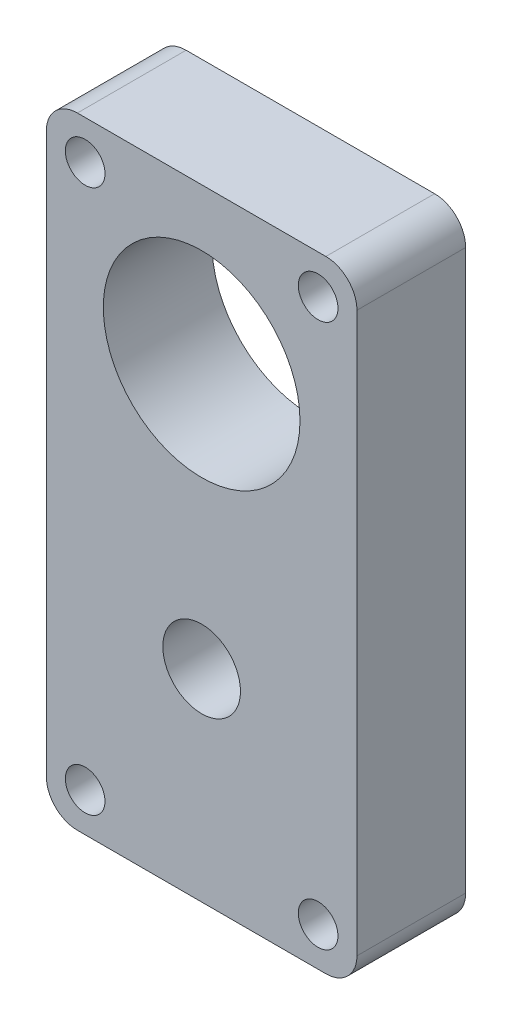
ISO-10303-21;
HEADER;
FILE_DESCRIPTION(('STEP AP214'),'2;1');
FILE_NAME('part.step','',(''),(''),'','','');
FILE_SCHEMA(('AUTOMOTIVE_DESIGN { 1 0 10303 214 1 1 1 1 }'));
ENDSEC;
DATA;
#1=APPLICATION_CONTEXT('core data for automotive mechanical design processes');
#2=APPLICATION_PROTOCOL_DEFINITION('international standard','automotive_design',2000,#1);
#3=PRODUCT_CONTEXT('',#1,'mechanical');
#4=PRODUCT('Part','Part','',(#3));
#5=PRODUCT_RELATED_PRODUCT_CATEGORY('part','',(#4));
#6=PRODUCT_DEFINITION_FORMATION('','',#4);
#7=PRODUCT_DEFINITION_CONTEXT('part definition',#1,'design');
#8=PRODUCT_DEFINITION('design','',#6,#7);
#9=PRODUCT_DEFINITION_SHAPE('','',#8);
#10=(LENGTH_UNIT() NAMED_UNIT(*) SI_UNIT(.MILLI.,.METRE.));
#11=(NAMED_UNIT(*) PLANE_ANGLE_UNIT() SI_UNIT($,.RADIAN.));
#12=(NAMED_UNIT(*) SI_UNIT($,.STERADIAN.) SOLID_ANGLE_UNIT());
#13=UNCERTAINTY_MEASURE_WITH_UNIT(LENGTH_MEASURE(1.E-05),#10,'distance_accuracy_value','');
#14=(GEOMETRIC_REPRESENTATION_CONTEXT(3) GLOBAL_UNCERTAINTY_ASSIGNED_CONTEXT((#13)) GLOBAL_UNIT_ASSIGNED_CONTEXT((#10,
#11,#12)) REPRESENTATION_CONTEXT('',''));
#15=CARTESIAN_POINT('',(0.,0.,0.));
#16=DIRECTION('',(0.,0.,1.));
#17=DIRECTION('',(1.,0.,0.));
#18=AXIS2_PLACEMENT_3D('',#15,#16,#17);
#19=CARTESIAN_POINT('',(0.,-34.,14.));
#20=DIRECTION('',(0.,0.,-1.));
#21=DIRECTION('',(-1.,0.,0.));
#22=AXIS2_PLACEMENT_3D('',#19,#20,#21);
#23=CYLINDRICAL_SURFACE('',#22,5.);
#24=CARTESIAN_POINT('',(0.,-34.,14.));
#25=DIRECTION('',(0.,0.,1.));
#26=DIRECTION('',(1.,0.,0.));
#27=AXIS2_PLACEMENT_3D('',#24,#25,#26);
#28=CIRCLE('',#27,5.);
#29=CARTESIAN_POINT('',(5.,-34.,14.));
#30=VERTEX_POINT('',#29);
#31=EDGE_CURVE('E210',#30,#30,#28,.T.);
#32=ORIENTED_EDGE('',*,*,#31,.T.);
#33=EDGE_LOOP('',(#32));
#34=FACE_BOUND('',#33,.T.);
#35=CARTESIAN_POINT('',(0.,-34.,2.));
#36=DIRECTION('',(0.,0.,-1.));
#37=DIRECTION('',(-1.,0.,0.));
#38=AXIS2_PLACEMENT_3D('',#35,#36,#37);
#39=CIRCLE('',#38,5.);
#40=CARTESIAN_POINT('',(-5.,-34.,2.));
#41=VERTEX_POINT('',#40);
#42=EDGE_CURVE('E38',#41,#41,#39,.T.);
#43=ORIENTED_EDGE('',*,*,#42,.T.);
#44=EDGE_LOOP('',(#43));
#45=FACE_BOUND('',#44,.T.);
#46=ADVANCED_FACE('F34',(#34,#45),#23,.F.);
#47=CARTESIAN_POINT('',(0.,0.,14.));
#48=DIRECTION('',(0.,0.,1.));
#49=DIRECTION('',(1.,0.,0.));
#50=AXIS2_PLACEMENT_3D('',#47,#48,#49);
#51=PLANE('',#50);
#52=CARTESIAN_POINT('',(15.,-55.,14.));
#53=DIRECTION('',(0.,0.,1.));
#54=DIRECTION('',(-1.,0.,0.));
#55=AXIS2_PLACEMENT_3D('',#52,#53,#54);
#56=CIRCLE('',#55,2.55459899986939);
#57=CARTESIAN_POINT('',(12.4454010001306,-55.,14.));
#58=VERTEX_POINT('',#57);
#59=EDGE_CURVE('E204',#58,#58,#56,.T.);
#60=ORIENTED_EDGE('',*,*,#59,.F.);
#61=EDGE_LOOP('',(#60));
#62=FACE_BOUND('',#61,.T.);
#63=CARTESIAN_POINT('',(-15.,-55.,14.));
#64=DIRECTION('',(0.,0.,1.));
#65=DIRECTION('',(-1.,0.,0.));
#66=AXIS2_PLACEMENT_3D('',#63,#64,#65);
#67=CIRCLE('',#66,2.55459899986931);
#68=CARTESIAN_POINT('',(-17.5545989998693,-55.,14.));
#69=VERTEX_POINT('',#68);
#70=EDGE_CURVE('E192',#69,#69,#67,.T.);
#71=ORIENTED_EDGE('',*,*,#70,.F.);
#72=EDGE_LOOP('',(#71));
#73=FACE_BOUND('',#72,.T.);
#74=CARTESIAN_POINT('',(-15.,15.,14.));
#75=DIRECTION('',(0.,0.,1.));
#76=DIRECTION('',(1.,0.,0.));
#77=AXIS2_PLACEMENT_3D('',#74,#75,#76);
#78=CIRCLE('',#77,2.55459899986932);
#79=CARTESIAN_POINT('',(-12.4454010001307,15.,14.));
#80=VERTEX_POINT('',#79);
#81=EDGE_CURVE('E178',#80,#80,#78,.T.);
#82=ORIENTED_EDGE('',*,*,#81,.F.);
#83=EDGE_LOOP('',(#82));
#84=FACE_BOUND('',#83,.T.);
#85=DIRECTION('',(1.,0.,0.));
#86=VECTOR('',#85,1.);
#87=CARTESIAN_POINT('',(-20.,-60.,14.));
#88=LINE('',#87,#86);
#89=CARTESIAN_POINT('',(-16.,-60.,14.));
#90=VERTEX_POINT('',#89);
#91=CARTESIAN_POINT('',(16.,-60.,14.));
#92=VERTEX_POINT('',#91);
#93=EDGE_CURVE('E172',#90,#92,#88,.T.);
#94=ORIENTED_EDGE('',*,*,#93,.T.);
#95=CARTESIAN_POINT('',(16.,-56.,14.));
#96=DIRECTION('',(0.,0.,1.));
#97=DIRECTION('',(1.,0.,0.));
#98=AXIS2_PLACEMENT_3D('',#95,#96,#97);
#99=CIRCLE('',#98,4.);
#100=CARTESIAN_POINT('',(20.,-56.,14.));
#101=VERTEX_POINT('',#100);
#102=EDGE_CURVE('E150',#92,#101,#99,.T.);
#103=ORIENTED_EDGE('',*,*,#102,.T.);
#104=DIRECTION('',(0.,1.,0.));
#105=VECTOR('',#104,1.);
#106=CARTESIAN_POINT('',(20.,-10.,14.));
#107=LINE('',#106,#105);
#108=CARTESIAN_POINT('',(20.,16.,14.));
#109=VERTEX_POINT('',#108);
#110=EDGE_CURVE('E120',#101,#109,#107,.T.);
#111=ORIENTED_EDGE('',*,*,#110,.T.);
#112=CARTESIAN_POINT('',(16.,16.,14.));
#113=DIRECTION('',(0.,0.,1.));
#114=DIRECTION('',(1.,0.,0.));
#115=AXIS2_PLACEMENT_3D('',#112,#113,#114);
#116=CIRCLE('',#115,4.);
#117=CARTESIAN_POINT('',(16.,20.,14.));
#118=VERTEX_POINT('',#117);
#119=EDGE_CURVE('E56',#109,#118,#116,.T.);
#120=ORIENTED_EDGE('',*,*,#119,.T.);
#121=DIRECTION('',(-1.,0.,0.));
#122=VECTOR('',#121,1.);
#123=CARTESIAN_POINT('',(20.,20.,14.));
#124=LINE('',#123,#122);
#125=CARTESIAN_POINT('',(-16.,20.,14.));
#126=VERTEX_POINT('',#125);
#127=EDGE_CURVE('E137',#118,#126,#124,.T.);
#128=ORIENTED_EDGE('',*,*,#127,.T.);
#129=CARTESIAN_POINT('',(-16.,16.,14.));
#130=DIRECTION('',(0.,0.,1.));
#131=DIRECTION('',(1.,0.,0.));
#132=AXIS2_PLACEMENT_3D('',#129,#130,#131);
#133=CIRCLE('',#132,4.);
#134=CARTESIAN_POINT('',(-20.,16.,14.));
#135=VERTEX_POINT('',#134);
#136=EDGE_CURVE('E145',#126,#135,#133,.T.);
#137=ORIENTED_EDGE('',*,*,#136,.T.);
#138=DIRECTION('',(0.,-1.,0.));
#139=VECTOR('',#138,1.);
#140=CARTESIAN_POINT('',(-20.,-9.99999999999999,14.));
#141=LINE('',#140,#139);
#142=CARTESIAN_POINT('',(-20.,-56.,14.));
#143=VERTEX_POINT('',#142);
#144=EDGE_CURVE('E131',#135,#143,#141,.T.);
#145=ORIENTED_EDGE('',*,*,#144,.T.);
#146=CARTESIAN_POINT('',(-16.,-56.,14.));
#147=DIRECTION('',(0.,0.,1.));
#148=DIRECTION('',(1.,0.,0.));
#149=AXIS2_PLACEMENT_3D('',#146,#147,#148);
#150=CIRCLE('',#149,4.);
#151=EDGE_CURVE('E148',#143,#90,#150,.T.);
#152=ORIENTED_EDGE('',*,*,#151,.T.);
#153=EDGE_LOOP('',(#94,#103,#111,#120,#128,#137,#145,#152));
#154=FACE_BOUND('',#153,.T.);
#155=CARTESIAN_POINT('',(0.,0.,14.));
#156=DIRECTION('',(0.,0.,1.));
#157=DIRECTION('',(1.,0.,0.));
#158=AXIS2_PLACEMENT_3D('',#155,#156,#157);
#159=CIRCLE('',#158,12.665);
#160=CARTESIAN_POINT('',(12.665,0.,14.));
#161=VERTEX_POINT('',#160);
#162=EDGE_CURVE('E187',#161,#161,#159,.T.);
#163=ORIENTED_EDGE('',*,*,#162,.F.);
#164=EDGE_LOOP('',(#163));
#165=FACE_BOUND('',#164,.T.);
#166=CARTESIAN_POINT('',(15.,15.,14.));
#167=DIRECTION('',(0.,0.,1.));
#168=DIRECTION('',(1.,0.,0.));
#169=AXIS2_PLACEMENT_3D('',#166,#167,#168);
#170=CIRCLE('',#169,2.55459899986937);
#171=CARTESIAN_POINT('',(17.5545989998694,15.,14.));
#172=VERTEX_POINT('',#171);
#173=EDGE_CURVE('E198',#172,#172,#170,.T.);
#174=ORIENTED_EDGE('',*,*,#173,.F.);
#175=EDGE_LOOP('',(#174));
#176=FACE_BOUND('',#175,.T.);
#177=ORIENTED_EDGE('',*,*,#31,.F.);
#178=EDGE_LOOP('',(#177));
#179=FACE_BOUND('',#178,.T.);
#180=ADVANCED_FACE('F168',(#62,#73,#84,#154,#165,#176,#179),#51,.T.);
#181=CARTESIAN_POINT('',(0.,0.,0.));
#182=DIRECTION('',(0.,0.,1.));
#183=DIRECTION('',(1.,0.,0.));
#184=AXIS2_PLACEMENT_3D('',#181,#182,#183);
#185=PLANE('',#184);
#186=DIRECTION('',(0.,1.,0.));
#187=VECTOR('',#186,1.);
#188=CARTESIAN_POINT('',(20.,-10.,0.));
#189=LINE('',#188,#187);
#190=CARTESIAN_POINT('',(20.,-56.,0.));
#191=VERTEX_POINT('',#190);
#192=CARTESIAN_POINT('',(20.,16.,0.));
#193=VERTEX_POINT('',#192);
#194=EDGE_CURVE('E118',#191,#193,#189,.T.);
#195=ORIENTED_EDGE('',*,*,#194,.F.);
#196=CARTESIAN_POINT('',(16.,-56.,0.));
#197=DIRECTION('',(0.,0.,1.));
#198=DIRECTION('',(1.,0.,0.));
#199=AXIS2_PLACEMENT_3D('',#196,#197,#198);
#200=CIRCLE('',#199,4.);
#201=CARTESIAN_POINT('',(16.,-60.,0.));
#202=VERTEX_POINT('',#201);
#203=EDGE_CURVE('E101',#191,#202,#200,.F.);
#204=ORIENTED_EDGE('',*,*,#203,.T.);
#205=DIRECTION('',(1.,0.,0.));
#206=VECTOR('',#205,1.);
#207=CARTESIAN_POINT('',(-20.,-60.,0.));
#208=LINE('',#207,#206);
#209=CARTESIAN_POINT('',(-16.,-60.,0.));
#210=VERTEX_POINT('',#209);
#211=EDGE_CURVE('E129',#210,#202,#208,.T.);
#212=ORIENTED_EDGE('',*,*,#211,.F.);
#213=CARTESIAN_POINT('',(-16.,-56.,0.));
#214=DIRECTION('',(0.,0.,1.));
#215=DIRECTION('',(1.,0.,0.));
#216=AXIS2_PLACEMENT_3D('',#213,#214,#215);
#217=CIRCLE('',#216,4.);
#218=CARTESIAN_POINT('',(-20.,-56.,0.));
#219=VERTEX_POINT('',#218);
#220=EDGE_CURVE('E112',#210,#219,#217,.F.);
#221=ORIENTED_EDGE('',*,*,#220,.T.);
#222=DIRECTION('',(0.,-1.,0.));
#223=VECTOR('',#222,1.);
#224=CARTESIAN_POINT('',(-20.,-9.99999999999999,0.));
#225=LINE('',#224,#223);
#226=CARTESIAN_POINT('',(-20.,16.,0.));
#227=VERTEX_POINT('',#226);
#228=EDGE_CURVE('E133',#227,#219,#225,.T.);
#229=ORIENTED_EDGE('',*,*,#228,.F.);
#230=CARTESIAN_POINT('',(-16.,16.,0.));
#231=DIRECTION('',(0.,0.,1.));
#232=DIRECTION('',(1.,0.,0.));
#233=AXIS2_PLACEMENT_3D('',#230,#231,#232);
#234=CIRCLE('',#233,4.);
#235=CARTESIAN_POINT('',(-16.,20.,0.));
#236=VERTEX_POINT('',#235);
#237=EDGE_CURVE('E121',#227,#236,#234,.F.);
#238=ORIENTED_EDGE('',*,*,#237,.T.);
#239=DIRECTION('',(-1.,0.,0.));
#240=VECTOR('',#239,1.);
#241=CARTESIAN_POINT('',(20.,20.,0.));
#242=LINE('',#241,#240);
#243=CARTESIAN_POINT('',(16.,20.,0.));
#244=VERTEX_POINT('',#243);
#245=EDGE_CURVE('E128',#244,#236,#242,.T.);
#246=ORIENTED_EDGE('',*,*,#245,.F.);
#247=CARTESIAN_POINT('',(16.,16.,0.));
#248=DIRECTION('',(0.,0.,1.));
#249=DIRECTION('',(1.,0.,0.));
#250=AXIS2_PLACEMENT_3D('',#247,#248,#249);
#251=CIRCLE('',#250,4.);
#252=EDGE_CURVE('E127',#244,#193,#251,.F.);
#253=ORIENTED_EDGE('',*,*,#252,.T.);
#254=EDGE_LOOP('',(#195,#204,#212,#221,#229,#238,#246,#253));
#255=FACE_BOUND('',#254,.T.);
#256=CARTESIAN_POINT('',(-15.,15.,0.));
#257=DIRECTION('',(0.,0.,1.));
#258=DIRECTION('',(1.,0.,0.));
#259=AXIS2_PLACEMENT_3D('',#256,#257,#258);
#260=CIRCLE('',#259,2.55459899986932);
#261=CARTESIAN_POINT('',(-12.4454010001307,15.,0.));
#262=VERTEX_POINT('',#261);
#263=EDGE_CURVE('E180',#262,#262,#260,.T.);
#264=ORIENTED_EDGE('',*,*,#263,.T.);
#265=EDGE_LOOP('',(#264));
#266=FACE_BOUND('',#265,.T.);
#267=CARTESIAN_POINT('',(0.,0.,0.));
#268=DIRECTION('',(0.,0.,1.));
#269=DIRECTION('',(1.,0.,0.));
#270=AXIS2_PLACEMENT_3D('',#267,#268,#269);
#271=CIRCLE('',#270,12.665);
#272=CARTESIAN_POINT('',(12.665,0.,0.));
#273=VERTEX_POINT('',#272);
#274=EDGE_CURVE('E189',#273,#273,#271,.T.);
#275=ORIENTED_EDGE('',*,*,#274,.T.);
#276=EDGE_LOOP('',(#275));
#277=FACE_BOUND('',#276,.T.);
#278=CARTESIAN_POINT('',(-15.,-55.,0.));
#279=DIRECTION('',(0.,0.,1.));
#280=DIRECTION('',(-1.,0.,0.));
#281=AXIS2_PLACEMENT_3D('',#278,#279,#280);
#282=CIRCLE('',#281,2.55459899986931);
#283=CARTESIAN_POINT('',(-17.5545989998693,-55.,0.));
#284=VERTEX_POINT('',#283);
#285=EDGE_CURVE('E195',#284,#284,#282,.T.);
#286=ORIENTED_EDGE('',*,*,#285,.T.);
#287=EDGE_LOOP('',(#286));
#288=FACE_BOUND('',#287,.T.);
#289=CARTESIAN_POINT('',(15.,15.,0.));
#290=DIRECTION('',(0.,0.,1.));
#291=DIRECTION('',(1.,0.,0.));
#292=AXIS2_PLACEMENT_3D('',#289,#290,#291);
#293=CIRCLE('',#292,2.55459899986937);
#294=CARTESIAN_POINT('',(17.5545989998694,15.,0.));
#295=VERTEX_POINT('',#294);
#296=EDGE_CURVE('E201',#295,#295,#293,.T.);
#297=ORIENTED_EDGE('',*,*,#296,.T.);
#298=EDGE_LOOP('',(#297));
#299=FACE_BOUND('',#298,.T.);
#300=CARTESIAN_POINT('',(15.,-55.,0.));
#301=DIRECTION('',(0.,0.,1.));
#302=DIRECTION('',(-1.,0.,0.));
#303=AXIS2_PLACEMENT_3D('',#300,#301,#302);
#304=CIRCLE('',#303,2.55459899986939);
#305=CARTESIAN_POINT('',(12.4454010001306,-55.,0.));
#306=VERTEX_POINT('',#305);
#307=EDGE_CURVE('E207',#306,#306,#304,.T.);
#308=ORIENTED_EDGE('',*,*,#307,.T.);
#309=EDGE_LOOP('',(#308));
#310=FACE_BOUND('',#309,.T.);
#311=ADVANCED_FACE('F124',(#255,#266,#277,#288,#299,#310),#185,.F.);
#312=CARTESIAN_POINT('',(-20.,-9.99999999999999,14.));
#313=DIRECTION('',(1.,0.,0.));
#314=DIRECTION('',(0.,1.,0.));
#315=AXIS2_PLACEMENT_3D('',#312,#313,#314);
#316=PLANE('',#315);
#317=ORIENTED_EDGE('',*,*,#228,.T.);
#318=DIRECTION('',(0.,0.,-1.));
#319=VECTOR('',#318,1.);
#320=CARTESIAN_POINT('',(-20.,-56.,14.));
#321=LINE('',#320,#319);
#322=EDGE_CURVE('E155',#219,#143,#321,.F.);
#323=ORIENTED_EDGE('',*,*,#322,.T.);
#324=ORIENTED_EDGE('',*,*,#144,.F.);
#325=DIRECTION('',(0.,0.,-1.));
#326=VECTOR('',#325,1.);
#327=CARTESIAN_POINT('',(-20.,16.,14.));
#328=LINE('',#327,#326);
#329=EDGE_CURVE('E152',#135,#227,#328,.T.);
#330=ORIENTED_EDGE('',*,*,#329,.T.);
#331=EDGE_LOOP('',(#317,#323,#324,#330));
#332=FACE_BOUND('',#331,.T.);
#333=ADVANCED_FACE('F162',(#332),#316,.F.);
#334=CARTESIAN_POINT('',(-20.,-60.,14.));
#335=DIRECTION('',(0.,1.,0.));
#336=DIRECTION('',(0.,0.,1.));
#337=AXIS2_PLACEMENT_3D('',#334,#335,#336);
#338=PLANE('',#337);
#339=ORIENTED_EDGE('',*,*,#211,.T.);
#340=DIRECTION('',(0.,0.,-1.));
#341=VECTOR('',#340,1.);
#342=CARTESIAN_POINT('',(16.,-60.,14.));
#343=LINE('',#342,#341);
#344=EDGE_CURVE('E106',#202,#92,#343,.F.);
#345=ORIENTED_EDGE('',*,*,#344,.T.);
#346=ORIENTED_EDGE('',*,*,#93,.F.);
#347=DIRECTION('',(0.,0.,-1.));
#348=VECTOR('',#347,1.);
#349=CARTESIAN_POINT('',(-16.,-60.,14.));
#350=LINE('',#349,#348);
#351=EDGE_CURVE('E111',#90,#210,#350,.T.);
#352=ORIENTED_EDGE('',*,*,#351,.T.);
#353=EDGE_LOOP('',(#339,#345,#346,#352));
#354=FACE_BOUND('',#353,.T.);
#355=ADVANCED_FACE('F177',(#354),#338,.F.);
#356=CARTESIAN_POINT('',(20.,-10.,14.));
#357=DIRECTION('',(-1.,0.,0.));
#358=DIRECTION('',(0.,-1.,0.));
#359=AXIS2_PLACEMENT_3D('',#356,#357,#358);
#360=PLANE('',#359);
#361=ORIENTED_EDGE('',*,*,#110,.F.);
#362=DIRECTION('',(0.,0.,-1.));
#363=VECTOR('',#362,1.);
#364=CARTESIAN_POINT('',(20.,-56.,14.));
#365=LINE('',#364,#363);
#366=EDGE_CURVE('E105',#101,#191,#365,.T.);
#367=ORIENTED_EDGE('',*,*,#366,.T.);
#368=ORIENTED_EDGE('',*,*,#194,.T.);
#369=DIRECTION('',(0.,0.,-1.));
#370=VECTOR('',#369,1.);
#371=CARTESIAN_POINT('',(20.,16.,14.));
#372=LINE('',#371,#370);
#373=EDGE_CURVE('E122',#193,#109,#372,.F.);
#374=ORIENTED_EDGE('',*,*,#373,.T.);
#375=EDGE_LOOP('',(#361,#367,#368,#374));
#376=FACE_BOUND('',#375,.T.);
#377=ADVANCED_FACE('F117',(#376),#360,.F.);
#378=CARTESIAN_POINT('',(20.,20.,14.));
#379=DIRECTION('',(0.,-1.,0.));
#380=DIRECTION('',(0.,0.,-1.));
#381=AXIS2_PLACEMENT_3D('',#378,#379,#380);
#382=PLANE('',#381);
#383=ORIENTED_EDGE('',*,*,#127,.F.);
#384=DIRECTION('',(0.,0.,-1.));
#385=VECTOR('',#384,1.);
#386=CARTESIAN_POINT('',(16.,20.,14.));
#387=LINE('',#386,#385);
#388=EDGE_CURVE('E11',#118,#244,#387,.T.);
#389=ORIENTED_EDGE('',*,*,#388,.T.);
#390=ORIENTED_EDGE('',*,*,#245,.T.);
#391=DIRECTION('',(0.,0.,-1.));
#392=VECTOR('',#391,1.);
#393=CARTESIAN_POINT('',(-16.,20.,14.));
#394=LINE('',#393,#392);
#395=EDGE_CURVE('E43',#236,#126,#394,.F.);
#396=ORIENTED_EDGE('',*,*,#395,.T.);
#397=EDGE_LOOP('',(#383,#389,#390,#396));
#398=FACE_BOUND('',#397,.T.);
#399=ADVANCED_FACE('F254',(#398),#382,.F.);
#400=CARTESIAN_POINT('',(-15.,15.,14.));
#401=DIRECTION('',(0.,0.,-1.));
#402=DIRECTION('',(-1.,0.,0.));
#403=AXIS2_PLACEMENT_3D('',#400,#401,#402);
#404=CYLINDRICAL_SURFACE('',#403,2.55459899986932);
#405=ORIENTED_EDGE('',*,*,#81,.T.);
#406=EDGE_LOOP('',(#405));
#407=FACE_BOUND('',#406,.T.);
#408=ORIENTED_EDGE('',*,*,#263,.F.);
#409=EDGE_LOOP('',(#408));
#410=FACE_BOUND('',#409,.T.);
#411=ADVANCED_FACE('F251',(#407,#410),#404,.F.);
#412=CARTESIAN_POINT('',(0.,0.,14.));
#413=DIRECTION('',(0.,0.,-1.));
#414=DIRECTION('',(-1.,0.,0.));
#415=AXIS2_PLACEMENT_3D('',#412,#413,#414);
#416=CYLINDRICAL_SURFACE('',#415,12.665);
#417=ORIENTED_EDGE('',*,*,#162,.T.);
#418=EDGE_LOOP('',(#417));
#419=FACE_BOUND('',#418,.T.);
#420=ORIENTED_EDGE('',*,*,#274,.F.);
#421=EDGE_LOOP('',(#420));
#422=FACE_BOUND('',#421,.T.);
#423=ADVANCED_FACE('F247',(#419,#422),#416,.F.);
#424=CARTESIAN_POINT('',(-15.,-55.,14.));
#425=DIRECTION('',(0.,0.,-1.));
#426=DIRECTION('',(-1.,0.,0.));
#427=AXIS2_PLACEMENT_3D('',#424,#425,#426);
#428=CYLINDRICAL_SURFACE('',#427,2.55459899986931);
#429=ORIENTED_EDGE('',*,*,#70,.T.);
#430=EDGE_LOOP('',(#429));
#431=FACE_BOUND('',#430,.T.);
#432=ORIENTED_EDGE('',*,*,#285,.F.);
#433=EDGE_LOOP('',(#432));
#434=FACE_BOUND('',#433,.T.);
#435=ADVANCED_FACE('F243',(#431,#434),#428,.F.);
#436=CARTESIAN_POINT('',(15.,15.,14.));
#437=DIRECTION('',(0.,0.,-1.));
#438=DIRECTION('',(-1.,0.,0.));
#439=AXIS2_PLACEMENT_3D('',#436,#437,#438);
#440=CYLINDRICAL_SURFACE('',#439,2.55459899986937);
#441=ORIENTED_EDGE('',*,*,#173,.T.);
#442=EDGE_LOOP('',(#441));
#443=FACE_BOUND('',#442,.T.);
#444=ORIENTED_EDGE('',*,*,#296,.F.);
#445=EDGE_LOOP('',(#444));
#446=FACE_BOUND('',#445,.T.);
#447=ADVANCED_FACE('F239',(#443,#446),#440,.F.);
#448=CARTESIAN_POINT('',(15.,-55.,14.));
#449=DIRECTION('',(0.,0.,-1.));
#450=DIRECTION('',(-1.,0.,0.));
#451=AXIS2_PLACEMENT_3D('',#448,#449,#450);
#452=CYLINDRICAL_SURFACE('',#451,2.55459899986939);
#453=ORIENTED_EDGE('',*,*,#59,.T.);
#454=EDGE_LOOP('',(#453));
#455=FACE_BOUND('',#454,.T.);
#456=ORIENTED_EDGE('',*,*,#307,.F.);
#457=EDGE_LOOP('',(#456));
#458=FACE_BOUND('',#457,.T.);
#459=ADVANCED_FACE('F236',(#455,#458),#452,.F.);
#460=CARTESIAN_POINT('',(16.,-56.,14.));
#461=DIRECTION('',(0.,0.,-1.));
#462=DIRECTION('',(-1.,0.,0.));
#463=AXIS2_PLACEMENT_3D('',#460,#461,#462);
#464=CYLINDRICAL_SURFACE('',#463,4.);
#465=ORIENTED_EDGE('',*,*,#102,.F.);
#466=ORIENTED_EDGE('',*,*,#344,.F.);
#467=ORIENTED_EDGE('',*,*,#203,.F.);
#468=ORIENTED_EDGE('',*,*,#366,.F.);
#469=EDGE_LOOP('',(#465,#466,#467,#468));
#470=FACE_BOUND('',#469,.T.);
#471=ADVANCED_FACE('F104',(#470),#464,.T.);
#472=CARTESIAN_POINT('',(-16.,-56.,14.));
#473=DIRECTION('',(0.,0.,-1.));
#474=DIRECTION('',(-1.,0.,0.));
#475=AXIS2_PLACEMENT_3D('',#472,#473,#474);
#476=CYLINDRICAL_SURFACE('',#475,4.);
#477=ORIENTED_EDGE('',*,*,#151,.F.);
#478=ORIENTED_EDGE('',*,*,#322,.F.);
#479=ORIENTED_EDGE('',*,*,#220,.F.);
#480=ORIENTED_EDGE('',*,*,#351,.F.);
#481=EDGE_LOOP('',(#477,#478,#479,#480));
#482=FACE_BOUND('',#481,.T.);
#483=ADVANCED_FACE('F175',(#482),#476,.T.);
#484=CARTESIAN_POINT('',(16.,16.,14.));
#485=DIRECTION('',(0.,0.,-1.));
#486=DIRECTION('',(-1.,0.,0.));
#487=AXIS2_PLACEMENT_3D('',#484,#485,#486);
#488=CYLINDRICAL_SURFACE('',#487,4.);
#489=ORIENTED_EDGE('',*,*,#119,.F.);
#490=ORIENTED_EDGE('',*,*,#373,.F.);
#491=ORIENTED_EDGE('',*,*,#252,.F.);
#492=ORIENTED_EDGE('',*,*,#388,.F.);
#493=EDGE_LOOP('',(#489,#490,#491,#492));
#494=FACE_BOUND('',#493,.T.);
#495=ADVANCED_FACE('F226',(#494),#488,.T.);
#496=CARTESIAN_POINT('',(-16.,16.,14.));
#497=DIRECTION('',(0.,0.,-1.));
#498=DIRECTION('',(-1.,0.,0.));
#499=AXIS2_PLACEMENT_3D('',#496,#497,#498);
#500=CYLINDRICAL_SURFACE('',#499,4.);
#501=ORIENTED_EDGE('',*,*,#136,.F.);
#502=ORIENTED_EDGE('',*,*,#395,.F.);
#503=ORIENTED_EDGE('',*,*,#237,.F.);
#504=ORIENTED_EDGE('',*,*,#329,.F.);
#505=EDGE_LOOP('',(#501,#502,#503,#504));
#506=FACE_BOUND('',#505,.T.);
#507=ADVANCED_FACE('F36',(#506),#500,.T.);
#508=CARTESIAN_POINT('',(0.,-34.,2.));
#509=DIRECTION('',(0.,0.,-1.));
#510=DIRECTION('',(-1.,0.,0.));
#511=AXIS2_PLACEMENT_3D('',#508,#509,#510);
#512=PLANE('',#511);
#513=ORIENTED_EDGE('',*,*,#42,.F.);
#514=EDGE_LOOP('',(#513));
#515=FACE_BOUND('',#514,.T.);
#516=ADVANCED_FACE('F220',(#515),#512,.F.);
#517=CLOSED_SHELL('',(#46,#180,#311,#333,#355,#377,#399,#411,#423,#435,#447,#459,#471,#483,#495,
#507,#516));
#518=MANIFOLD_SOLID_BREP('B2',#517);
#519=ADVANCED_BREP_SHAPE_REPRESENTATION('',(#18,#518),#14);
#520=SHAPE_DEFINITION_REPRESENTATION(#9,#519);
ENDSEC;
END-ISO-10303-21;
